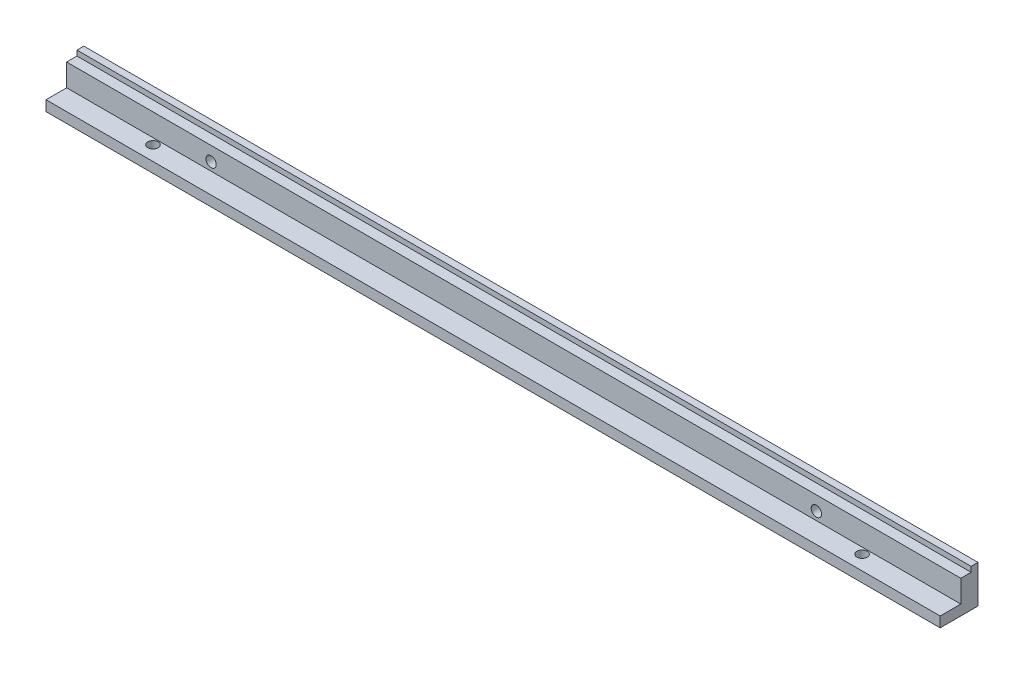
ISO-10303-21;
HEADER;
FILE_DESCRIPTION(('STEP AP214'),'2;1');
FILE_NAME('part.step','',(''),(''),'','','');
FILE_SCHEMA(('AUTOMOTIVE_DESIGN { 1 0 10303 214 1 1 1 1 }'));
ENDSEC;
DATA;
#1=APPLICATION_CONTEXT('core data for automotive mechanical design processes');
#2=APPLICATION_PROTOCOL_DEFINITION('international standard','automotive_design',2000,#1);
#3=PRODUCT_CONTEXT('',#1,'mechanical');
#4=PRODUCT('Part','Part','',(#3));
#5=PRODUCT_RELATED_PRODUCT_CATEGORY('part','',(#4));
#6=PRODUCT_DEFINITION_FORMATION('','',#4);
#7=PRODUCT_DEFINITION_CONTEXT('part definition',#1,'design');
#8=PRODUCT_DEFINITION('design','',#6,#7);
#9=PRODUCT_DEFINITION_SHAPE('','',#8);
#10=(LENGTH_UNIT() NAMED_UNIT(*) SI_UNIT(.MILLI.,.METRE.));
#11=(NAMED_UNIT(*) PLANE_ANGLE_UNIT() SI_UNIT($,.RADIAN.));
#12=(NAMED_UNIT(*) SI_UNIT($,.STERADIAN.) SOLID_ANGLE_UNIT());
#13=UNCERTAINTY_MEASURE_WITH_UNIT(LENGTH_MEASURE(1.E-05),#10,'distance_accuracy_value','');
#14=(GEOMETRIC_REPRESENTATION_CONTEXT(3) GLOBAL_UNCERTAINTY_ASSIGNED_CONTEXT((#13)) GLOBAL_UNIT_ASSIGNED_CONTEXT((#10,
#11,#12)) REPRESENTATION_CONTEXT('',''));
#15=CARTESIAN_POINT('',(0.,0.,0.));
#16=DIRECTION('',(0.,0.,1.));
#17=DIRECTION('',(1.,0.,0.));
#18=AXIS2_PLACEMENT_3D('',#15,#16,#17);
#19=CARTESIAN_POINT('',(260.,11.,0.));
#20=DIRECTION('',(0.,0.,1.));
#21=DIRECTION('',(0.,-1.,0.));
#22=AXIS2_PLACEMENT_3D('',#19,#20,#21);
#23=PLANE('',#22);
#24=CARTESIAN_POINT('',(218.,5.4,0.));
#25=DIRECTION('',(0.,0.,1.));
#26=DIRECTION('',(-1.,0.,0.));
#27=AXIS2_PLACEMENT_3D('',#24,#25,#26);
#28=CIRCLE('',#27,1.5);
#29=CARTESIAN_POINT('',(216.5,5.4,0.));
#30=VERTEX_POINT('',#29);
#31=EDGE_CURVE('E180',#30,#30,#28,.T.);
#32=ORIENTED_EDGE('',*,*,#31,.T.);
#33=EDGE_LOOP('',(#32));
#34=FACE_BOUND('',#33,.T.);
#35=CARTESIAN_POINT('',(42.,5.4,0.));
#36=DIRECTION('',(0.,0.,1.));
#37=DIRECTION('',(1.,0.,0.));
#38=AXIS2_PLACEMENT_3D('',#35,#36,#37);
#39=CIRCLE('',#38,1.5);
#40=CARTESIAN_POINT('',(43.5,5.4,0.));
#41=VERTEX_POINT('',#40);
#42=EDGE_CURVE('E133',#41,#41,#39,.T.);
#43=ORIENTED_EDGE('',*,*,#42,.T.);
#44=EDGE_LOOP('',(#43));
#45=FACE_BOUND('',#44,.T.);
#46=DIRECTION('',(0.,1.,0.));
#47=VECTOR('',#46,1.);
#48=CARTESIAN_POINT('',(0.,11.,0.));
#49=LINE('',#48,#47);
#50=CARTESIAN_POINT('',(0.,0.,0.));
#51=VERTEX_POINT('',#50);
#52=CARTESIAN_POINT('',(0.,11.,0.));
#53=VERTEX_POINT('',#52);
#54=EDGE_CURVE('E129',#51,#53,#49,.T.);
#55=ORIENTED_EDGE('',*,*,#54,.T.);
#56=DIRECTION('',(-1.,0.,0.));
#57=VECTOR('',#56,1.);
#58=CARTESIAN_POINT('',(260.,11.,0.));
#59=LINE('',#58,#57);
#60=CARTESIAN_POINT('',(260.,11.,0.));
#61=VERTEX_POINT('',#60);
#62=EDGE_CURVE('E11',#61,#53,#59,.T.);
#63=ORIENTED_EDGE('',*,*,#62,.F.);
#64=DIRECTION('',(0.,1.,0.));
#65=VECTOR('',#64,1.);
#66=CARTESIAN_POINT('',(260.,11.,0.));
#67=LINE('',#66,#65);
#68=CARTESIAN_POINT('',(260.,0.,0.));
#69=VERTEX_POINT('',#68);
#70=EDGE_CURVE('E144',#69,#61,#67,.T.);
#71=ORIENTED_EDGE('',*,*,#70,.F.);
#72=DIRECTION('',(-1.,0.,0.));
#73=VECTOR('',#72,1.);
#74=CARTESIAN_POINT('',(260.,0.,0.));
#75=LINE('',#74,#73);
#76=EDGE_CURVE('E125',#69,#51,#75,.T.);
#77=ORIENTED_EDGE('',*,*,#76,.T.);
#78=EDGE_LOOP('',(#55,#63,#71,#77));
#79=FACE_BOUND('',#78,.T.);
#80=ADVANCED_FACE('F33',(#34,#45,#79),#23,.F.);
#81=CARTESIAN_POINT('',(260.,11.,2.));
#82=DIRECTION('',(0.,-1.,0.));
#83=DIRECTION('',(0.,0.,-1.));
#84=AXIS2_PLACEMENT_3D('',#81,#82,#83);
#85=PLANE('',#84);
#86=DIRECTION('',(0.,0.,1.));
#87=VECTOR('',#86,1.);
#88=CARTESIAN_POINT('',(0.,11.,2.));
#89=LINE('',#88,#87);
#90=CARTESIAN_POINT('',(0.,11.,2.));
#91=VERTEX_POINT('',#90);
#92=EDGE_CURVE('E132',#53,#91,#89,.T.);
#93=ORIENTED_EDGE('',*,*,#92,.T.);
#94=DIRECTION('',(-1.,0.,0.));
#95=VECTOR('',#94,1.);
#96=CARTESIAN_POINT('',(260.,11.,2.));
#97=LINE('',#96,#95);
#98=CARTESIAN_POINT('',(260.,11.,2.));
#99=VERTEX_POINT('',#98);
#100=EDGE_CURVE('E41',#99,#91,#97,.T.);
#101=ORIENTED_EDGE('',*,*,#100,.F.);
#102=DIRECTION('',(0.,0.,1.));
#103=VECTOR('',#102,1.);
#104=CARTESIAN_POINT('',(260.,11.,2.));
#105=LINE('',#104,#103);
#106=EDGE_CURVE('E92',#61,#99,#105,.T.);
#107=ORIENTED_EDGE('',*,*,#106,.F.);
#108=ORIENTED_EDGE('',*,*,#62,.T.);
#109=EDGE_LOOP('',(#93,#101,#107,#108));
#110=FACE_BOUND('',#109,.T.);
#111=ADVANCED_FACE('F228',(#110),#85,.F.);
#112=CARTESIAN_POINT('',(260.,9.5,2.));
#113=DIRECTION('',(0.,0.,-1.));
#114=DIRECTION('',(-1.,0.,0.));
#115=AXIS2_PLACEMENT_3D('',#112,#113,#114);
#116=PLANE('',#115);
#117=DIRECTION('',(0.,-1.,0.));
#118=VECTOR('',#117,1.);
#119=CARTESIAN_POINT('',(0.,9.5,2.));
#120=LINE('',#119,#118);
#121=CARTESIAN_POINT('',(0.,9.5,2.));
#122=VERTEX_POINT('',#121);
#123=EDGE_CURVE('E135',#91,#122,#120,.T.);
#124=ORIENTED_EDGE('',*,*,#123,.T.);
#125=DIRECTION('',(-1.,0.,0.));
#126=VECTOR('',#125,1.);
#127=CARTESIAN_POINT('',(260.,9.5,2.));
#128=LINE('',#127,#126);
#129=CARTESIAN_POINT('',(260.,9.5,2.));
#130=VERTEX_POINT('',#129);
#131=EDGE_CURVE('E151',#130,#122,#128,.T.);
#132=ORIENTED_EDGE('',*,*,#131,.F.);
#133=DIRECTION('',(0.,-1.,0.));
#134=VECTOR('',#133,1.);
#135=CARTESIAN_POINT('',(260.,9.5,2.));
#136=LINE('',#135,#134);
#137=EDGE_CURVE('E159',#99,#130,#136,.T.);
#138=ORIENTED_EDGE('',*,*,#137,.F.);
#139=ORIENTED_EDGE('',*,*,#100,.T.);
#140=EDGE_LOOP('',(#124,#132,#138,#139));
#141=FACE_BOUND('',#140,.T.);
#142=ADVANCED_FACE('F157',(#141),#116,.F.);
#143=CARTESIAN_POINT('',(260.,9.5,5.));
#144=DIRECTION('',(0.,-1.,0.));
#145=DIRECTION('',(0.,0.,-1.));
#146=AXIS2_PLACEMENT_3D('',#143,#144,#145);
#147=PLANE('',#146);
#148=DIRECTION('',(0.,0.,1.));
#149=VECTOR('',#148,1.);
#150=CARTESIAN_POINT('',(0.,9.5,5.));
#151=LINE('',#150,#149);
#152=CARTESIAN_POINT('',(0.,9.5,5.));
#153=VERTEX_POINT('',#152);
#154=EDGE_CURVE('E137',#122,#153,#151,.T.);
#155=ORIENTED_EDGE('',*,*,#154,.T.);
#156=DIRECTION('',(-1.,0.,0.));
#157=VECTOR('',#156,1.);
#158=CARTESIAN_POINT('',(260.,9.5,5.));
#159=LINE('',#158,#157);
#160=CARTESIAN_POINT('',(260.,9.5,5.));
#161=VERTEX_POINT('',#160);
#162=EDGE_CURVE('E148',#161,#153,#159,.T.);
#163=ORIENTED_EDGE('',*,*,#162,.F.);
#164=DIRECTION('',(0.,0.,1.));
#165=VECTOR('',#164,1.);
#166=CARTESIAN_POINT('',(260.,9.5,5.));
#167=LINE('',#166,#165);
#168=EDGE_CURVE('E171',#130,#161,#167,.T.);
#169=ORIENTED_EDGE('',*,*,#168,.F.);
#170=ORIENTED_EDGE('',*,*,#131,.T.);
#171=EDGE_LOOP('',(#155,#163,#169,#170));
#172=FACE_BOUND('',#171,.T.);
#173=ADVANCED_FACE('F167',(#172),#147,.F.);
#174=CARTESIAN_POINT('',(260.,3.,5.));
#175=DIRECTION('',(0.,0.,-1.));
#176=DIRECTION('',(-1.,0.,0.));
#177=AXIS2_PLACEMENT_3D('',#174,#175,#176);
#178=PLANE('',#177);
#179=CARTESIAN_POINT('',(218.,5.4,5.));
#180=DIRECTION('',(0.,0.,1.));
#181=DIRECTION('',(-1.,0.,0.));
#182=AXIS2_PLACEMENT_3D('',#179,#180,#181);
#183=CIRCLE('',#182,1.5);
#184=CARTESIAN_POINT('',(216.5,5.4,5.));
#185=VERTEX_POINT('',#184);
#186=EDGE_CURVE('E183',#185,#185,#183,.T.);
#187=ORIENTED_EDGE('',*,*,#186,.F.);
#188=EDGE_LOOP('',(#187));
#189=FACE_BOUND('',#188,.T.);
#190=CARTESIAN_POINT('',(42.,5.4,5.));
#191=DIRECTION('',(0.,0.,1.));
#192=DIRECTION('',(1.,0.,0.));
#193=AXIS2_PLACEMENT_3D('',#190,#191,#192);
#194=CIRCLE('',#193,1.5);
#195=CARTESIAN_POINT('',(43.5,5.4,5.));
#196=VERTEX_POINT('',#195);
#197=EDGE_CURVE('E177',#196,#196,#194,.T.);
#198=ORIENTED_EDGE('',*,*,#197,.F.);
#199=EDGE_LOOP('',(#198));
#200=FACE_BOUND('',#199,.T.);
#201=DIRECTION('',(0.,-1.,0.));
#202=VECTOR('',#201,1.);
#203=CARTESIAN_POINT('',(0.,3.,5.));
#204=LINE('',#203,#202);
#205=CARTESIAN_POINT('',(0.,3.,5.));
#206=VERTEX_POINT('',#205);
#207=EDGE_CURVE('E139',#153,#206,#204,.T.);
#208=ORIENTED_EDGE('',*,*,#207,.T.);
#209=DIRECTION('',(-1.,0.,0.));
#210=VECTOR('',#209,1.);
#211=CARTESIAN_POINT('',(260.,3.,5.));
#212=LINE('',#211,#210);
#213=CARTESIAN_POINT('',(260.,3.,5.));
#214=VERTEX_POINT('',#213);
#215=EDGE_CURVE('E120',#214,#206,#212,.T.);
#216=ORIENTED_EDGE('',*,*,#215,.F.);
#217=DIRECTION('',(0.,-1.,0.));
#218=VECTOR('',#217,1.);
#219=CARTESIAN_POINT('',(260.,3.,5.));
#220=LINE('',#219,#218);
#221=EDGE_CURVE('E111',#161,#214,#220,.T.);
#222=ORIENTED_EDGE('',*,*,#221,.F.);
#223=ORIENTED_EDGE('',*,*,#162,.T.);
#224=EDGE_LOOP('',(#208,#216,#222,#223));
#225=FACE_BOUND('',#224,.T.);
#226=ADVANCED_FACE('F170',(#189,#200,#225),#178,.F.);
#227=CARTESIAN_POINT('',(260.,3.,11.));
#228=DIRECTION('',(0.,-1.,0.));
#229=DIRECTION('',(0.,0.,-1.));
#230=AXIS2_PLACEMENT_3D('',#227,#228,#229);
#231=PLANE('',#230);
#232=CARTESIAN_POINT('',(233.09,3.,6.79999999999999));
#233=DIRECTION('',(0.,1.,0.));
#234=DIRECTION('',(0.,0.,-1.));
#235=AXIS2_PLACEMENT_3D('',#232,#233,#234);
#236=CIRCLE('',#235,1.5);
#237=CARTESIAN_POINT('',(233.09,3.,5.3));
#238=VERTEX_POINT('',#237);
#239=EDGE_CURVE('E195',#238,#238,#236,.T.);
#240=ORIENTED_EDGE('',*,*,#239,.F.);
#241=EDGE_LOOP('',(#240));
#242=FACE_BOUND('',#241,.T.);
#243=CARTESIAN_POINT('',(26.91,3.,6.79999999999999));
#244=DIRECTION('',(0.,1.,0.));
#245=DIRECTION('',(0.,0.,1.));
#246=AXIS2_PLACEMENT_3D('',#243,#244,#245);
#247=CIRCLE('',#246,1.5);
#248=CARTESIAN_POINT('',(26.91,3.,8.3));
#249=VERTEX_POINT('',#248);
#250=EDGE_CURVE('E189',#249,#249,#247,.T.);
#251=ORIENTED_EDGE('',*,*,#250,.F.);
#252=EDGE_LOOP('',(#251));
#253=FACE_BOUND('',#252,.T.);
#254=DIRECTION('',(0.,0.,1.));
#255=VECTOR('',#254,1.);
#256=CARTESIAN_POINT('',(0.,3.,11.));
#257=LINE('',#256,#255);
#258=CARTESIAN_POINT('',(0.,3.,11.));
#259=VERTEX_POINT('',#258);
#260=EDGE_CURVE('E119',#206,#259,#257,.T.);
#261=ORIENTED_EDGE('',*,*,#260,.T.);
#262=DIRECTION('',(-1.,0.,0.));
#263=VECTOR('',#262,1.);
#264=CARTESIAN_POINT('',(260.,3.,11.));
#265=LINE('',#264,#263);
#266=CARTESIAN_POINT('',(260.,3.,11.));
#267=VERTEX_POINT('',#266);
#268=EDGE_CURVE('E116',#267,#259,#265,.T.);
#269=ORIENTED_EDGE('',*,*,#268,.F.);
#270=DIRECTION('',(0.,0.,1.));
#271=VECTOR('',#270,1.);
#272=CARTESIAN_POINT('',(260.,3.,11.));
#273=LINE('',#272,#271);
#274=EDGE_CURVE('E105',#214,#267,#273,.T.);
#275=ORIENTED_EDGE('',*,*,#274,.F.);
#276=ORIENTED_EDGE('',*,*,#215,.T.);
#277=EDGE_LOOP('',(#261,#269,#275,#276));
#278=FACE_BOUND('',#277,.T.);
#279=ADVANCED_FACE('F117',(#242,#253,#278),#231,.F.);
#280=CARTESIAN_POINT('',(260.,0.,11.));
#281=DIRECTION('',(0.,0.,-1.));
#282=DIRECTION('',(-1.,0.,0.));
#283=AXIS2_PLACEMENT_3D('',#280,#281,#282);
#284=PLANE('',#283);
#285=DIRECTION('',(0.,-1.,0.));
#286=VECTOR('',#285,1.);
#287=CARTESIAN_POINT('',(0.,0.,11.));
#288=LINE('',#287,#286);
#289=CARTESIAN_POINT('',(0.,0.,11.));
#290=VERTEX_POINT('',#289);
#291=EDGE_CURVE('E78',#259,#290,#288,.T.);
#292=ORIENTED_EDGE('',*,*,#291,.T.);
#293=DIRECTION('',(-1.,0.,0.));
#294=VECTOR('',#293,1.);
#295=CARTESIAN_POINT('',(260.,0.,11.));
#296=LINE('',#295,#294);
#297=CARTESIAN_POINT('',(260.,0.,11.));
#298=VERTEX_POINT('',#297);
#299=EDGE_CURVE('E121',#298,#290,#296,.T.);
#300=ORIENTED_EDGE('',*,*,#299,.F.);
#301=DIRECTION('',(0.,-1.,0.));
#302=VECTOR('',#301,1.);
#303=CARTESIAN_POINT('',(260.,0.,11.));
#304=LINE('',#303,#302);
#305=EDGE_CURVE('E109',#267,#298,#304,.T.);
#306=ORIENTED_EDGE('',*,*,#305,.F.);
#307=ORIENTED_EDGE('',*,*,#268,.T.);
#308=EDGE_LOOP('',(#292,#300,#306,#307));
#309=FACE_BOUND('',#308,.T.);
#310=ADVANCED_FACE('F123',(#309),#284,.F.);
#311=CARTESIAN_POINT('',(260.,0.,0.));
#312=DIRECTION('',(0.,1.,0.));
#313=DIRECTION('',(0.,0.,1.));
#314=AXIS2_PLACEMENT_3D('',#311,#312,#313);
#315=PLANE('',#314);
#316=CARTESIAN_POINT('',(233.09,0.,6.79999999999999));
#317=DIRECTION('',(0.,1.,0.));
#318=DIRECTION('',(0.,0.,-1.));
#319=AXIS2_PLACEMENT_3D('',#316,#317,#318);
#320=CIRCLE('',#319,1.5);
#321=CARTESIAN_POINT('',(233.09,0.,5.3));
#322=VERTEX_POINT('',#321);
#323=EDGE_CURVE('E192',#322,#322,#320,.T.);
#324=ORIENTED_EDGE('',*,*,#323,.T.);
#325=EDGE_LOOP('',(#324));
#326=FACE_BOUND('',#325,.T.);
#327=CARTESIAN_POINT('',(26.91,0.,6.79999999999999));
#328=DIRECTION('',(0.,1.,0.));
#329=DIRECTION('',(0.,0.,1.));
#330=AXIS2_PLACEMENT_3D('',#327,#328,#329);
#331=CIRCLE('',#330,1.5);
#332=CARTESIAN_POINT('',(26.91,0.,8.3));
#333=VERTEX_POINT('',#332);
#334=EDGE_CURVE('E186',#333,#333,#331,.T.);
#335=ORIENTED_EDGE('',*,*,#334,.T.);
#336=EDGE_LOOP('',(#335));
#337=FACE_BOUND('',#336,.T.);
#338=DIRECTION('',(0.,0.,-1.));
#339=VECTOR('',#338,1.);
#340=CARTESIAN_POINT('',(0.,0.,0.));
#341=LINE('',#340,#339);
#342=EDGE_CURVE('E84',#290,#51,#341,.T.);
#343=ORIENTED_EDGE('',*,*,#342,.T.);
#344=ORIENTED_EDGE('',*,*,#76,.F.);
#345=DIRECTION('',(0.,0.,-1.));
#346=VECTOR('',#345,1.);
#347=CARTESIAN_POINT('',(260.,0.,0.));
#348=LINE('',#347,#346);
#349=EDGE_CURVE('E49',#298,#69,#348,.T.);
#350=ORIENTED_EDGE('',*,*,#349,.F.);
#351=ORIENTED_EDGE('',*,*,#299,.T.);
#352=EDGE_LOOP('',(#343,#344,#350,#351));
#353=FACE_BOUND('',#352,.T.);
#354=ADVANCED_FACE('F201',(#326,#337,#353),#315,.F.);
#355=CARTESIAN_POINT('',(260.,0.,0.));
#356=DIRECTION('',(-1.,0.,0.));
#357=DIRECTION('',(0.,0.,1.));
#358=AXIS2_PLACEMENT_3D('',#355,#356,#357);
#359=PLANE('',#358);
#360=ORIENTED_EDGE('',*,*,#70,.T.);
#361=ORIENTED_EDGE('',*,*,#106,.T.);
#362=ORIENTED_EDGE('',*,*,#137,.T.);
#363=ORIENTED_EDGE('',*,*,#168,.T.);
#364=ORIENTED_EDGE('',*,*,#221,.T.);
#365=ORIENTED_EDGE('',*,*,#274,.T.);
#366=ORIENTED_EDGE('',*,*,#305,.T.);
#367=ORIENTED_EDGE('',*,*,#349,.T.);
#368=EDGE_LOOP('',(#360,#361,#362,#363,#364,#365,#366,#367));
#369=FACE_BOUND('',#368,.T.);
#370=ADVANCED_FACE('F107',(#369),#359,.F.);
#371=CARTESIAN_POINT('',(0.,0.,0.));
#372=DIRECTION('',(-1.,0.,0.));
#373=DIRECTION('',(0.,0.,1.));
#374=AXIS2_PLACEMENT_3D('',#371,#372,#373);
#375=PLANE('',#374);
#376=ORIENTED_EDGE('',*,*,#54,.F.);
#377=ORIENTED_EDGE('',*,*,#342,.F.);
#378=ORIENTED_EDGE('',*,*,#291,.F.);
#379=ORIENTED_EDGE('',*,*,#260,.F.);
#380=ORIENTED_EDGE('',*,*,#207,.F.);
#381=ORIENTED_EDGE('',*,*,#154,.F.);
#382=ORIENTED_EDGE('',*,*,#123,.F.);
#383=ORIENTED_EDGE('',*,*,#92,.F.);
#384=EDGE_LOOP('',(#376,#377,#378,#379,#380,#381,#382,#383));
#385=FACE_BOUND('',#384,.T.);
#386=ADVANCED_FACE('F163',(#385),#375,.T.);
#387=CARTESIAN_POINT('',(42.,5.4,0.));
#388=DIRECTION('',(0.,0.,1.));
#389=DIRECTION('',(1.,0.,0.));
#390=AXIS2_PLACEMENT_3D('',#387,#388,#389);
#391=CYLINDRICAL_SURFACE('',#390,1.5);
#392=ORIENTED_EDGE('',*,*,#42,.F.);
#393=EDGE_LOOP('',(#392));
#394=FACE_BOUND('',#393,.T.);
#395=ORIENTED_EDGE('',*,*,#197,.T.);
#396=EDGE_LOOP('',(#395));
#397=FACE_BOUND('',#396,.T.);
#398=ADVANCED_FACE('F223',(#394,#397),#391,.F.);
#399=CARTESIAN_POINT('',(218.,5.4,0.));
#400=DIRECTION('',(0.,0.,1.));
#401=DIRECTION('',(1.,0.,0.));
#402=AXIS2_PLACEMENT_3D('',#399,#400,#401);
#403=CYLINDRICAL_SURFACE('',#402,1.5);
#404=ORIENTED_EDGE('',*,*,#31,.F.);
#405=EDGE_LOOP('',(#404));
#406=FACE_BOUND('',#405,.T.);
#407=ORIENTED_EDGE('',*,*,#186,.T.);
#408=EDGE_LOOP('',(#407));
#409=FACE_BOUND('',#408,.T.);
#410=ADVANCED_FACE('F217',(#406,#409),#403,.F.);
#411=CARTESIAN_POINT('',(26.91,0.,6.79999999999999));
#412=DIRECTION('',(0.,1.,0.));
#413=DIRECTION('',(0.,0.,1.));
#414=AXIS2_PLACEMENT_3D('',#411,#412,#413);
#415=CYLINDRICAL_SURFACE('',#414,1.5);
#416=ORIENTED_EDGE('',*,*,#334,.F.);
#417=EDGE_LOOP('',(#416));
#418=FACE_BOUND('',#417,.T.);
#419=ORIENTED_EDGE('',*,*,#250,.T.);
#420=EDGE_LOOP('',(#419));
#421=FACE_BOUND('',#420,.T.);
#422=ADVANCED_FACE('F207',(#418,#421),#415,.F.);
#423=CARTESIAN_POINT('',(233.09,0.,6.79999999999999));
#424=DIRECTION('',(0.,1.,0.));
#425=DIRECTION('',(0.,0.,1.));
#426=AXIS2_PLACEMENT_3D('',#423,#424,#425);
#427=CYLINDRICAL_SURFACE('',#426,1.5);
#428=ORIENTED_EDGE('',*,*,#323,.F.);
#429=EDGE_LOOP('',(#428));
#430=FACE_BOUND('',#429,.T.);
#431=ORIENTED_EDGE('',*,*,#239,.T.);
#432=EDGE_LOOP('',(#431));
#433=FACE_BOUND('',#432,.T.);
#434=ADVANCED_FACE('F204',(#430,#433),#427,.F.);
#435=CLOSED_SHELL('',(#80,#111,#142,#173,#226,#279,#310,#354,#370,#386,#398,#410,#422,#434));
#436=MANIFOLD_SOLID_BREP('B2',#435);
#437=ADVANCED_BREP_SHAPE_REPRESENTATION('',(#18,#436),#14);
#438=SHAPE_DEFINITION_REPRESENTATION(#9,#437);
ENDSEC;
END-ISO-10303-21;
